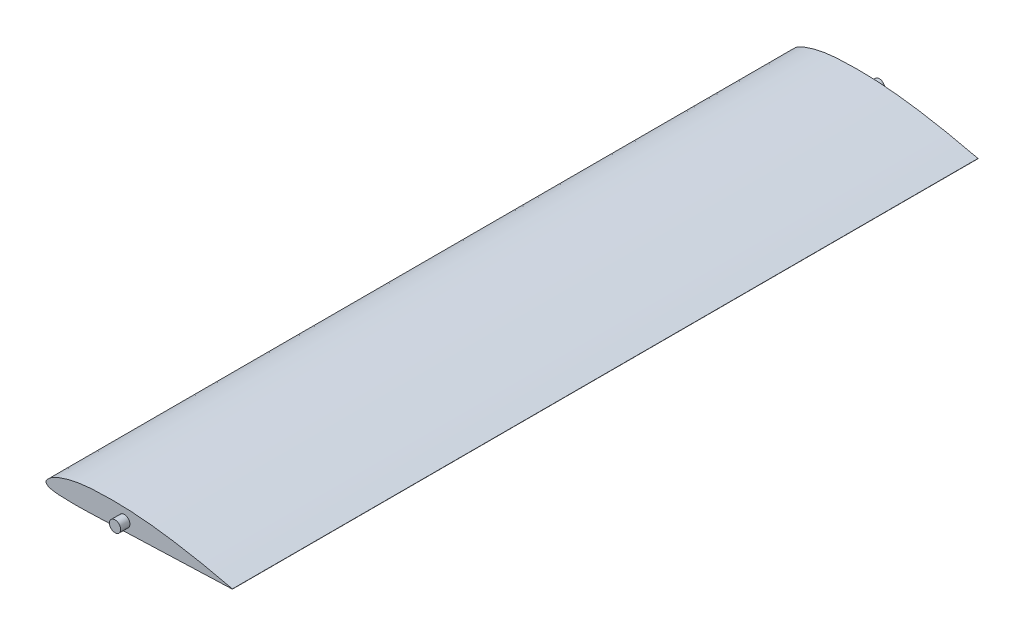
ISO-10303-21;
HEADER;
FILE_DESCRIPTION(('STEP AP214'),'2;1');
FILE_NAME('part.step','',(''),(''),'','','');
FILE_SCHEMA(('AUTOMOTIVE_DESIGN { 1 0 10303 214 1 1 1 1 }'));
ENDSEC;
DATA;
#1=APPLICATION_CONTEXT('core data for automotive mechanical design processes');
#2=APPLICATION_PROTOCOL_DEFINITION('international standard','automotive_design',2000,#1);
#3=PRODUCT_CONTEXT('',#1,'mechanical');
#4=PRODUCT('Part','Part','',(#3));
#5=PRODUCT_RELATED_PRODUCT_CATEGORY('part','',(#4));
#6=PRODUCT_DEFINITION_FORMATION('','',#4);
#7=PRODUCT_DEFINITION_CONTEXT('part definition',#1,'design');
#8=PRODUCT_DEFINITION('design','',#6,#7);
#9=PRODUCT_DEFINITION_SHAPE('','',#8);
#10=(LENGTH_UNIT() NAMED_UNIT(*) SI_UNIT(.MILLI.,.METRE.));
#11=(NAMED_UNIT(*) PLANE_ANGLE_UNIT() SI_UNIT($,.RADIAN.));
#12=(NAMED_UNIT(*) SI_UNIT($,.STERADIAN.) SOLID_ANGLE_UNIT());
#13=UNCERTAINTY_MEASURE_WITH_UNIT(LENGTH_MEASURE(1.E-05),#10,'distance_accuracy_value','');
#14=(GEOMETRIC_REPRESENTATION_CONTEXT(3) GLOBAL_UNCERTAINTY_ASSIGNED_CONTEXT((#13)) GLOBAL_UNIT_ASSIGNED_CONTEXT((#10,
#11,#12)) REPRESENTATION_CONTEXT('',''));
#15=CARTESIAN_POINT('',(0.,0.,0.));
#16=DIRECTION('',(0.,0.,1.));
#17=DIRECTION('',(1.,0.,0.));
#18=AXIS2_PLACEMENT_3D('',#15,#16,#17);
#19=CARTESIAN_POINT('',(100.,0.0599262388252568,200.));
#20=CARTESIAN_POINT('',(99.6666937471953,0.138937277819544,200.));
#21=CARTESIAN_POINT('',(99.0001200889136,0.29695014695678,200.));
#22=CARTESIAN_POINT('',(98.0002515533694,0.533477244963055,200.));
#23=CARTESIAN_POINT('',(97.000374753558,0.768863581512203,200.));
#24=CARTESIAN_POINT('',(95.6675638818466,1.08042383442665,200.));
#25=CARTESIAN_POINT('',(94.0015713267341,1.46392103728522,200.));
#26=CARTESIAN_POINT('',(92.0016073919942,1.91292836940954,200.));
#27=CARTESIAN_POINT('',(90.0016619586486,2.35152966974612,200.));
#28=CARTESIAN_POINT('',(88.0017829611692,2.78020773959593,200.));
#29=CARTESIAN_POINT('',(86.0019223338707,3.19874024657641,200.));
#30=CARTESIAN_POINT('',(83.3368337556686,3.74244691183134,200.));
#31=CARTESIAN_POINT('',(79.3412466183781,4.5250421804744,200.));
#32=CARTESIAN_POINT('',(75.3392538145284,5.25148062943361,200.));
#33=CARTESIAN_POINT('',(72.0027253739576,5.81745509130285,200.));
#34=CARTESIAN_POINT('',(69.3374940518809,6.25363383384628,200.));
#35=CARTESIAN_POINT('',(66.671131319661,6.66608548709222,200.));
#36=CARTESIAN_POINT('',(64.0033198872574,7.05020381979708,200.));
#37=CARTESIAN_POINT('',(62.0034586271341,7.32270043486086,200.));
#38=CARTESIAN_POINT('',(59.3383485069764,7.66383985259429,200.));
#39=CARTESIAN_POINT('',(56.6716358083318,7.96962568358589,200.));
#40=CARTESIAN_POINT('',(54.0037479902221,8.23951382186876,200.));
#41=CARTESIAN_POINT('',(52.0037982726727,8.4238676451509,200.));
#42=CARTESIAN_POINT('',(50.0038486317892,8.59013070529199,200.));
#43=CARTESIAN_POINT('',(48.0039333020934,8.73835747467576,200.));
#44=CARTESIAN_POINT('',(46.0040101309834,8.86719176837719,200.));
#45=CARTESIAN_POINT('',(44.0040593332397,8.97493832366112,200.));
#46=CARTESIAN_POINT('',(42.0040821596146,9.06001958046446,200.));
#47=CARTESIAN_POINT('',(40.0040731567784,9.1208964493308,200.));
#48=CARTESIAN_POINT('',(38.0040282570697,9.15563694063745,200.));
#49=CARTESIAN_POINT('',(36.0040108423488,9.16581868041082,200.));
#50=CARTESIAN_POINT('',(34.0040286769316,9.15359713766184,200.));
#51=CARTESIAN_POINT('',(32.0040752193951,9.12107905673638,200.));
#52=CARTESIAN_POINT('',(30.0041471019016,9.07004894425062,200.));
#53=CARTESIAN_POINT('',(28.0040546424125,9.00350156707454,200.));
#54=CARTESIAN_POINT('',(26.0037496913816,8.91339581318333,200.));
#55=CARTESIAN_POINT('',(24.0031983162326,8.7896544069115,200.));
#56=CARTESIAN_POINT('',(22.0023296617593,8.62243845725377,200.));
#57=CARTESIAN_POINT('',(20.0010745390591,8.40177808713544,200.));
#58=CARTESIAN_POINT('',(18.0001198967842,8.11642817046847,200.));
#59=CARTESIAN_POINT('',(15.999442233662,7.76590833510291,200.));
#60=CARTESIAN_POINT('',(13.9982119601745,7.35263431618153,200.));
#61=CARTESIAN_POINT('',(11.9957414652928,6.8724495756903,200.));
#62=CARTESIAN_POINT('',(9.99230431153847,6.31164730517832,200.));
#63=CARTESIAN_POINT('',(7.98916365138914,5.65305895317212,200.));
#64=CARTESIAN_POINT('',(6.3218293284431,5.02399233802199,200.));
#65=CARTESIAN_POINT('',(4.99299983329978,4.43216070472373,200.));
#66=CARTESIAN_POINT('',(3.98595394102813,3.9166422218935,200.));
#67=CARTESIAN_POINT('',(2.9699117061556,3.30400904730935,200.));
#68=CARTESIAN_POINT('',(2.0318835901488,2.5892541788095,200.));
#69=CARTESIAN_POINT('',(1.32737948939748,1.91099608261548,200.));
#70=CARTESIAN_POINT('',(0.789670593846766,1.36578653625942,200.));
#71=CARTESIAN_POINT('',(0.448168069350981,0.967197603138533,200.));
#72=CARTESIAN_POINT('',(0.223663801945147,0.624140905691418,200.));
#73=CARTESIAN_POINT('',(0.1137781557551,0.399455594554814,200.));
#74=CARTESIAN_POINT('',(0.043632385728852,0.205862057390237,200.));
#75=CARTESIAN_POINT('',(-0.0198883515278164,-0.0738589686266174,200.));
#76=CARTESIAN_POINT('',(0.0124051264481509,-0.364936741274751,200.));
#77=CARTESIAN_POINT('',(0.113724473026408,-0.618296039676128,200.));
#78=CARTESIAN_POINT('',(0.222486641363497,-0.819796167286998,200.));
#79=CARTESIAN_POINT('',(0.443568240966514,-1.11344864435438,200.));
#80=CARTESIAN_POINT('',(0.780453339052533,-1.4248000936736,200.));
#81=CARTESIAN_POINT('',(1.30604862893995,-1.78052396731398,200.));
#82=CARTESIAN_POINT('',(2.05183270843198,-2.06869764211714,200.));
#83=CARTESIAN_POINT('',(3.00325105018696,-2.26024676868709,200.));
#84=CARTESIAN_POINT('',(4.0024554593713,-2.45904698588516,200.));
#85=CARTESIAN_POINT('',(5.00311660931094,-2.61177293914944,200.));
#86=CARTESIAN_POINT('',(6.33653916249594,-2.7530354007047,200.));
#87=CARTESIAN_POINT('',(8.00492721912424,-2.84913347497257,200.));
#88=CARTESIAN_POINT('',(10.0049572494609,-2.94390068327674,200.));
#89=CARTESIAN_POINT('',(12.0052123395452,-3.00116332741795,200.));
#90=CARTESIAN_POINT('',(14.0053024566046,-3.0282522848526,200.));
#91=CARTESIAN_POINT('',(16.0053292778908,-3.02892273184658,200.));
#92=CARTESIAN_POINT('',(18.0052800224887,-3.00767531964872,200.));
#93=CARTESIAN_POINT('',(20.0051777945989,-2.9686328713825,200.));
#94=CARTESIAN_POINT('',(22.0050473068617,-2.91601512663668,200.));
#95=CARTESIAN_POINT('',(24.6716550963808,-2.83183500372688,200.));
#96=CARTESIAN_POINT('',(27.3380018749195,-2.73259929417434,200.));
#97=CARTESIAN_POINT('',(30.0043700143892,-2.63035819470935,200.));
#98=CARTESIAN_POINT('',(32.6708442720964,-2.53025362851953,200.));
#99=CARTESIAN_POINT('',(35.3373679416196,-2.4326649144542,200.));
#100=CARTESIAN_POINT('',(38.0038913254057,-2.33591665262994,200.));
#101=CARTESIAN_POINT('',(40.0037721780932,-2.26333625322643,200.));
#102=CARTESIAN_POINT('',(42.0036465977938,-2.19034482230209,200.));
#103=CARTESIAN_POINT('',(44.0035182461694,-2.11697830380754,200.));
#104=CARTESIAN_POINT('',(46.670017485067,-2.01890568610885,200.));
#105=CARTESIAN_POINT('',(50.0031312573799,-1.89598519544122,200.));
#106=CARTESIAN_POINT('',(53.3362590115835,-1.77348772259095,200.));
#107=CARTESIAN_POINT('',(56.0027611286881,-1.67561365785624,200.));
#108=CARTESIAN_POINT('',(58.0026356232561,-1.602215298639,200.));
#109=CARTESIAN_POINT('',(60.6691366143914,-1.50438396404022,200.));
#110=CARTESIAN_POINT('',(63.3356349399315,-1.40646333496689,200.));
#111=CARTESIAN_POINT('',(66.0021342888123,-1.30854391966599,200.));
#112=CARTESIAN_POINT('',(68.0020080156601,-1.23506799636606,200.));
#113=CARTESIAN_POINT('',(70.0018828544842,-1.16161901321269,200.));
#114=CARTESIAN_POINT('',(72.0017570255992,-1.08815851751289,200.));
#115=CARTESIAN_POINT('',(79.3346307898534,-0.818873580449789,200.));
#116=CARTESIAN_POINT('',(86.6675033412425,-0.549558952993169,200.));
#117=CARTESIAN_POINT('',(94.3336889484509,-0.268022582925601,200.));
#118=CARTESIAN_POINT('',(96.333563230566,-0.19457510815205,200.));
#119=CARTESIAN_POINT('',(98.3334383197885,-0.121146277650695,200.));
#120=CARTESIAN_POINT('',(99.3333751558733,-0.0844109030073011,200.));
#121=CARTESIAN_POINT('',(100.,-0.0599262388252568,200.));
#122=B_SPLINE_CURVE_WITH_KNOTS('',3,(#19,#20,#21,#22,#23,#24,#25,#26,#27,#28,#29,#30,#31,#32,
#33,#34,#35,#36,#37,#38,#39,#40,#41,#42,#43,#44,#45,#46,#47,#48,#49,#50,#51,#52,#53,#54,#55,#56,
#57,#58,#59,#60,#61,#62,#63,#64,#65,#66,#67,#68,#69,#70,#71,#72,#73,#74,#75,#76,#77,#78,#79,#80,
#81,#82,#83,#84,#85,#86,#87,#88,#89,#90,#91,#92,#93,#94,#95,#96,#97,#98,#99,#100,#101,#102,#103,
#104,#105,#106,#107,#108,#109,#110,#111,#112,#113,#114,#115,#116,#117,#118,#119,#120,#121),
.UNSPECIFIED.,.F.,.F.,(4,1,1,1,1,1,1,1,1,1,1,1,1,1,1,1,1,1,1,1,1,1,1,1,1,1,1,1,1,1,1,1,1,1,1,1,
1,1,1,1,1,1,1,1,1,1,1,1,1,1,1,1,1,1,1,1,1,1,1,1,1,1,1,1,1,1,1,1,1,1,1,1,1,1,1,1,1,1,1,1,1,1,1,1,
1,1,1,1,1,1,1,1,1,1,1,1,1,1,1,1,4),(0.,0.00502780144909913,0.0100550169006377,0.015080974345154,
0.0201050442625927,0.0301452176602554,0.0401735710380291,0.0501908143801514,0.0601976592093663,
0.0701941952761396,0.0801803076747985,0.100121039985459,0.129954283487186,0.139878670112855,
0.149793455313975,0.169594377782908,0.179479765251136,0.189354684839631,0.199219006508967,
0.218916577845098,0.228751143399973,0.238577240977566,0.248395623877617,0.258207005858822,
0.268011824770028,0.277810571771131,0.287603995418777,0.297393106812531,0.307179233213968,
0.316963997331707,0.326748797903093,0.33653469577821,0.346322446388005,0.356112708583029,
0.365907629610281,0.375711447611164,0.385530843159723,0.395375732502448,0.405259309582702,
0.415192466448778,0.425184001433878,0.435248265754516,0.445412161758921,0.45571079591912,
0.46619092382004,0.471552117343181,0.4770544290882,0.482786856201749,0.488945964995898,
0.494315961999465,0.497126380520384,0.500187407498847,0.502001032204753,0.503128101310879,
0.50384991606385,0.505020081617257,0.507317850057375,0.507986412168226,0.509023655480889,
0.51066801325332,0.513358343761831,0.515715835490153,0.519949409091746,0.524973134176378,
0.529954392708037,0.534903201948304,0.539824096808236,0.549630394694461,0.559425349382671,
0.569214158123137,0.578999725456637,0.588784356167783,0.598569501410984,0.608355927361906,
0.618143876254531,0.627933302401491,0.647515398126826,0.65730711994173,0.66709865127694,
0.68668110949836,0.696472189275363,0.706263270828206,0.716054412904857,0.725845617580213,
0.735636859958337,0.755219387900134,0.774801863673185,0.784593082698806,0.794384298135396,
0.804175511777837,0.823757953419086,0.833549177830085,0.843340405832555,0.853131632039167,
0.86292285824578,0.872714082656778,0.960835102355763,0.970626326766761,0.985313162485574,
0.990208773793388,1.),.UNSPECIFIED.);
#123=DIRECTION('',(0.,0.,-1.));
#124=VECTOR('',#123,1.);
#125=SURFACE_OF_LINEAR_EXTRUSION('',#122,#124);
#126=CARTESIAN_POINT('',(100.,0.0599262388252568,-200.));
#127=CARTESIAN_POINT('',(99.6666937471953,0.138937277819544,-200.));
#128=CARTESIAN_POINT('',(99.0001200889136,0.29695014695678,-200.));
#129=CARTESIAN_POINT('',(98.0002515533694,0.533477244963055,-200.));
#130=CARTESIAN_POINT('',(97.000374753558,0.768863581512203,-200.));
#131=CARTESIAN_POINT('',(95.6675638818466,1.08042383442665,-200.));
#132=CARTESIAN_POINT('',(94.0015713267341,1.46392103728522,-200.));
#133=CARTESIAN_POINT('',(92.0016073919942,1.91292836940954,-200.));
#134=CARTESIAN_POINT('',(90.0016619586486,2.35152966974612,-200.));
#135=CARTESIAN_POINT('',(88.0017829611692,2.78020773959593,-200.));
#136=CARTESIAN_POINT('',(86.0019223338707,3.19874024657641,-200.));
#137=CARTESIAN_POINT('',(83.3368337556686,3.74244691183134,-200.));
#138=CARTESIAN_POINT('',(79.3412466183781,4.5250421804744,-200.));
#139=CARTESIAN_POINT('',(75.3392538145284,5.25148062943361,-200.));
#140=CARTESIAN_POINT('',(72.0027253739576,5.81745509130285,-200.));
#141=CARTESIAN_POINT('',(69.3374940518809,6.25363383384628,-200.));
#142=CARTESIAN_POINT('',(66.671131319661,6.66608548709222,-200.));
#143=CARTESIAN_POINT('',(64.0033198872574,7.05020381979708,-200.));
#144=CARTESIAN_POINT('',(62.0034586271341,7.32270043486086,-200.));
#145=CARTESIAN_POINT('',(59.3383485069764,7.66383985259429,-200.));
#146=CARTESIAN_POINT('',(56.6716358083318,7.96962568358589,-200.));
#147=CARTESIAN_POINT('',(54.0037479902221,8.23951382186876,-200.));
#148=CARTESIAN_POINT('',(52.0037982726727,8.4238676451509,-200.));
#149=CARTESIAN_POINT('',(50.0038486317892,8.59013070529199,-200.));
#150=CARTESIAN_POINT('',(48.0039333020934,8.73835747467576,-200.));
#151=CARTESIAN_POINT('',(46.0040101309834,8.86719176837719,-200.));
#152=CARTESIAN_POINT('',(44.0040593332397,8.97493832366112,-200.));
#153=CARTESIAN_POINT('',(42.0040821596146,9.06001958046446,-200.));
#154=CARTESIAN_POINT('',(40.0040731567784,9.1208964493308,-200.));
#155=CARTESIAN_POINT('',(38.0040282570697,9.15563694063745,-200.));
#156=CARTESIAN_POINT('',(36.0040108423488,9.16581868041082,-200.));
#157=CARTESIAN_POINT('',(34.0040286769316,9.15359713766184,-200.));
#158=CARTESIAN_POINT('',(32.0040752193951,9.12107905673638,-200.));
#159=CARTESIAN_POINT('',(30.0041471019016,9.07004894425062,-200.));
#160=CARTESIAN_POINT('',(28.0040546424125,9.00350156707454,-200.));
#161=CARTESIAN_POINT('',(26.0037496913816,8.91339581318333,-200.));
#162=CARTESIAN_POINT('',(24.0031983162326,8.7896544069115,-200.));
#163=CARTESIAN_POINT('',(22.0023296617593,8.62243845725377,-200.));
#164=CARTESIAN_POINT('',(20.0010745390591,8.40177808713544,-200.));
#165=CARTESIAN_POINT('',(18.0001198967842,8.11642817046847,-200.));
#166=CARTESIAN_POINT('',(15.999442233662,7.76590833510291,-200.));
#167=CARTESIAN_POINT('',(13.9982119601745,7.35263431618153,-200.));
#168=CARTESIAN_POINT('',(11.9957414652928,6.8724495756903,-200.));
#169=CARTESIAN_POINT('',(9.99230431153847,6.31164730517832,-200.));
#170=CARTESIAN_POINT('',(7.98916365138914,5.65305895317212,-200.));
#171=CARTESIAN_POINT('',(6.3218293284431,5.02399233802199,-200.));
#172=CARTESIAN_POINT('',(4.99299983329978,4.43216070472373,-200.));
#173=CARTESIAN_POINT('',(3.98595394102813,3.9166422218935,-200.));
#174=CARTESIAN_POINT('',(2.9699117061556,3.30400904730935,-200.));
#175=CARTESIAN_POINT('',(2.0318835901488,2.5892541788095,-200.));
#176=CARTESIAN_POINT('',(1.32737948939748,1.91099608261548,-200.));
#177=CARTESIAN_POINT('',(0.789670593846766,1.36578653625942,-200.));
#178=CARTESIAN_POINT('',(0.448168069350981,0.967197603138533,-200.));
#179=CARTESIAN_POINT('',(0.223663801945147,0.624140905691418,-200.));
#180=CARTESIAN_POINT('',(0.1137781557551,0.399455594554814,-200.));
#181=CARTESIAN_POINT('',(0.043632385728852,0.205862057390237,-200.));
#182=CARTESIAN_POINT('',(-0.0198883515278164,-0.0738589686266174,-200.));
#183=CARTESIAN_POINT('',(0.0124051264481509,-0.364936741274751,-200.));
#184=CARTESIAN_POINT('',(0.113724473026408,-0.618296039676128,-200.));
#185=CARTESIAN_POINT('',(0.222486641363497,-0.819796167286998,-200.));
#186=CARTESIAN_POINT('',(0.443568240966514,-1.11344864435438,-200.));
#187=CARTESIAN_POINT('',(0.780453339052533,-1.4248000936736,-200.));
#188=CARTESIAN_POINT('',(1.30604862893995,-1.78052396731398,-200.));
#189=CARTESIAN_POINT('',(2.05183270843198,-2.06869764211714,-200.));
#190=CARTESIAN_POINT('',(3.00325105018696,-2.26024676868709,-200.));
#191=CARTESIAN_POINT('',(4.0024554593713,-2.45904698588516,-200.));
#192=CARTESIAN_POINT('',(5.00311660931094,-2.61177293914944,-200.));
#193=CARTESIAN_POINT('',(6.33653916249594,-2.7530354007047,-200.));
#194=CARTESIAN_POINT('',(8.00492721912424,-2.84913347497257,-200.));
#195=CARTESIAN_POINT('',(10.0049572494609,-2.94390068327674,-200.));
#196=CARTESIAN_POINT('',(12.0052123395452,-3.00116332741795,-200.));
#197=CARTESIAN_POINT('',(14.0053024566046,-3.0282522848526,-200.));
#198=CARTESIAN_POINT('',(16.0053292778908,-3.02892273184658,-200.));
#199=CARTESIAN_POINT('',(18.0052800224887,-3.00767531964872,-200.));
#200=CARTESIAN_POINT('',(20.0051777945989,-2.9686328713825,-200.));
#201=CARTESIAN_POINT('',(22.0050473068617,-2.91601512663668,-200.));
#202=CARTESIAN_POINT('',(24.6716550963808,-2.83183500372688,-200.));
#203=CARTESIAN_POINT('',(27.3380018749195,-2.73259929417434,-200.));
#204=CARTESIAN_POINT('',(30.0043700143892,-2.63035819470935,-200.));
#205=CARTESIAN_POINT('',(32.6708442720964,-2.53025362851953,-200.));
#206=CARTESIAN_POINT('',(35.3373679416196,-2.4326649144542,-200.));
#207=CARTESIAN_POINT('',(38.0038913254057,-2.33591665262994,-200.));
#208=CARTESIAN_POINT('',(40.0037721780932,-2.26333625322643,-200.));
#209=CARTESIAN_POINT('',(42.0036465977938,-2.19034482230209,-200.));
#210=CARTESIAN_POINT('',(44.0035182461694,-2.11697830380754,-200.));
#211=CARTESIAN_POINT('',(46.670017485067,-2.01890568610885,-200.));
#212=CARTESIAN_POINT('',(50.0031312573799,-1.89598519544122,-200.));
#213=CARTESIAN_POINT('',(53.3362590115835,-1.77348772259095,-200.));
#214=CARTESIAN_POINT('',(56.0027611286881,-1.67561365785624,-200.));
#215=CARTESIAN_POINT('',(58.0026356232561,-1.602215298639,-200.));
#216=CARTESIAN_POINT('',(60.6691366143914,-1.50438396404022,-200.));
#217=CARTESIAN_POINT('',(63.3356349399315,-1.40646333496689,-200.));
#218=CARTESIAN_POINT('',(66.0021342888123,-1.30854391966599,-200.));
#219=CARTESIAN_POINT('',(68.0020080156601,-1.23506799636606,-200.));
#220=CARTESIAN_POINT('',(70.0018828544842,-1.16161901321269,-200.));
#221=CARTESIAN_POINT('',(72.0017570255992,-1.08815851751289,-200.));
#222=CARTESIAN_POINT('',(79.3346307898534,-0.818873580449789,-200.));
#223=CARTESIAN_POINT('',(86.6675033412425,-0.549558952993169,-200.));
#224=CARTESIAN_POINT('',(94.3336889484509,-0.268022582925601,-200.));
#225=CARTESIAN_POINT('',(96.333563230566,-0.19457510815205,-200.));
#226=CARTESIAN_POINT('',(98.3334383197885,-0.121146277650695,-200.));
#227=CARTESIAN_POINT('',(99.3333751558733,-0.0844109030073011,-200.));
#228=CARTESIAN_POINT('',(100.,-0.0599262388252568,-200.));
#229=B_SPLINE_CURVE_WITH_KNOTS('',3,(#126,#127,#128,#129,#130,#131,#132,#133,#134,#135,#136,
#137,#138,#139,#140,#141,#142,#143,#144,#145,#146,#147,#148,#149,#150,#151,#152,#153,#154,#155,
#156,#157,#158,#159,#160,#161,#162,#163,#164,#165,#166,#167,#168,#169,#170,#171,#172,#173,#174,
#175,#176,#177,#178,#179,#180,#181,#182,#183,#184,#185,#186,#187,#188,#189,#190,#191,#192,#193,
#194,#195,#196,#197,#198,#199,#200,#201,#202,#203,#204,#205,#206,#207,#208,#209,#210,#211,#212,
#213,#214,#215,#216,#217,#218,#219,#220,#221,#222,#223,#224,#225,#226,#227,#228),.UNSPECIFIED.,
.F.,.F.,(4,1,1,1,1,1,1,1,1,1,1,1,1,1,1,1,1,1,1,1,1,1,1,1,1,1,1,1,1,1,1,1,1,1,1,1,1,1,1,1,1,1,1,
1,1,1,1,1,1,1,1,1,1,1,1,1,1,1,1,1,1,1,1,1,1,1,1,1,1,1,1,1,1,1,1,1,1,1,1,1,1,1,1,1,1,1,1,1,1,1,1,
1,1,1,1,1,1,1,1,1,4),(0.,0.00502780144909913,0.0100550169006377,0.015080974345154,
0.0201050442625927,0.0301452176602554,0.0401735710380291,0.0501908143801514,0.0601976592093663,
0.0701941952761396,0.0801803076747985,0.100121039985459,0.129954283487186,0.139878670112855,
0.149793455313975,0.169594377782908,0.179479765251136,0.189354684839631,0.199219006508967,
0.218916577845098,0.228751143399973,0.238577240977566,0.248395623877617,0.258207005858822,
0.268011824770028,0.277810571771131,0.287603995418777,0.297393106812531,0.307179233213968,
0.316963997331707,0.326748797903093,0.33653469577821,0.346322446388005,0.356112708583029,
0.365907629610281,0.375711447611164,0.385530843159723,0.395375732502448,0.405259309582702,
0.415192466448778,0.425184001433878,0.435248265754516,0.445412161758921,0.45571079591912,
0.46619092382004,0.471552117343181,0.4770544290882,0.482786856201749,0.488945964995898,
0.494315961999465,0.497126380520384,0.500187407498847,0.502001032204753,0.503128101310879,
0.50384991606385,0.505020081617257,0.507317850057375,0.507986412168226,0.509023655480889,
0.51066801325332,0.513358343761831,0.515715835490153,0.519949409091746,0.524973134176378,
0.529954392708037,0.534903201948304,0.539824096808236,0.549630394694461,0.559425349382671,
0.569214158123137,0.578999725456637,0.588784356167783,0.598569501410984,0.608355927361906,
0.618143876254531,0.627933302401491,0.647515398126826,0.65730711994173,0.66709865127694,
0.68668110949836,0.696472189275363,0.706263270828206,0.716054412904857,0.725845617580213,
0.735636859958337,0.755219387900134,0.774801863673185,0.784593082698806,0.794384298135396,
0.804175511777837,0.823757953419086,0.833549177830085,0.843340405832555,0.853131632039167,
0.86292285824578,0.872714082656778,0.960835102355763,0.970626326766761,0.985313162485574,
0.990208773793388,1.),.UNSPECIFIED.);
#230=CARTESIAN_POINT('',(100.,0.0599262388252568,-200.));
#231=VERTEX_POINT('',#230);
#232=CARTESIAN_POINT('',(100.,-0.0599262388252568,-200.));
#233=VERTEX_POINT('',#232);
#234=EDGE_CURVE('E67',#231,#233,#229,.T.);
#235=ORIENTED_EDGE('',*,*,#234,.T.);
#236=DIRECTION('',(0.,0.,-1.));
#237=VECTOR('',#236,1.);
#238=CARTESIAN_POINT('',(100.,-0.0599262388252568,200.));
#239=LINE('',#238,#237);
#240=CARTESIAN_POINT('',(100.,-0.0599262388252568,200.));
#241=VERTEX_POINT('',#240);
#242=EDGE_CURVE('E49',#241,#233,#239,.T.);
#243=ORIENTED_EDGE('',*,*,#242,.F.);
#244=CARTESIAN_POINT('',(100.,0.0599262388252568,200.));
#245=VERTEX_POINT('',#244);
#246=EDGE_CURVE('E69',#245,#241,#122,.T.);
#247=ORIENTED_EDGE('',*,*,#246,.F.);
#248=DIRECTION('',(0.,0.,-1.));
#249=VECTOR('',#248,1.);
#250=CARTESIAN_POINT('',(100.,0.0599262388252568,200.));
#251=LINE('',#250,#249);
#252=EDGE_CURVE('E57',#245,#231,#251,.T.);
#253=ORIENTED_EDGE('',*,*,#252,.T.);
#254=EDGE_LOOP('',(#235,#243,#247,#253));
#255=FACE_BOUND('',#254,.T.);
#256=ADVANCED_FACE('F40',(#255),#125,.F.);
#257=CARTESIAN_POINT('',(100.,0.0599262388252568,200.));
#258=DIRECTION('',(1.,0.,0.));
#259=DIRECTION('',(0.,0.,-1.));
#260=AXIS2_PLACEMENT_3D('',#257,#258,#259);
#261=PLANE('',#260);
#262=DIRECTION('',(0.,-1.,0.));
#263=VECTOR('',#262,1.);
#264=CARTESIAN_POINT('',(100.,0.0599262388252568,-200.));
#265=LINE('',#264,#263);
#266=EDGE_CURVE('E75',#231,#233,#265,.T.);
#267=ORIENTED_EDGE('',*,*,#266,.F.);
#268=ORIENTED_EDGE('',*,*,#252,.F.);
#269=DIRECTION('',(0.,-1.,0.));
#270=VECTOR('',#269,1.);
#271=CARTESIAN_POINT('',(100.,0.0599262388252568,200.));
#272=LINE('',#271,#270);
#273=EDGE_CURVE('E71',#245,#241,#272,.T.);
#274=ORIENTED_EDGE('',*,*,#273,.T.);
#275=ORIENTED_EDGE('',*,*,#242,.T.);
#276=EDGE_LOOP('',(#267,#268,#274,#275));
#277=FACE_BOUND('',#276,.T.);
#278=ADVANCED_FACE('F78',(#277),#261,.T.);
#279=CARTESIAN_POINT('',(0.428902417831239,0.923239688894012,200.));
#280=DIRECTION('',(0.,0.,-1.));
#281=DIRECTION('',(-1.,0.,0.));
#282=AXIS2_PLACEMENT_3D('',#279,#280,#281);
#283=PLANE('',#282);
#284=CARTESIAN_POINT('',(42.0369180056575,2.66916615668644,200.));
#285=DIRECTION('',(0.,0.,-1.));
#286=DIRECTION('',(-1.,0.,0.));
#287=AXIS2_PLACEMENT_3D('',#284,#285,#286);
#288=CIRCLE('',#287,3.);
#289=CARTESIAN_POINT('',(39.0369180056575,2.66916615668644,200.));
#290=VERTEX_POINT('',#289);
#291=EDGE_CURVE('E90',#290,#290,#288,.T.);
#292=ORIENTED_EDGE('',*,*,#291,.T.);
#293=EDGE_LOOP('',(#292));
#294=FACE_BOUND('',#293,.T.);
#295=ORIENTED_EDGE('',*,*,#246,.T.);
#296=ORIENTED_EDGE('',*,*,#273,.F.);
#297=EDGE_LOOP('',(#295,#296));
#298=FACE_BOUND('',#297,.T.);
#299=ADVANCED_FACE('F113',(#294,#298),#283,.F.);
#300=CARTESIAN_POINT('',(0.428902417831239,0.923239688894012,-200.));
#301=DIRECTION('',(0.,0.,-1.));
#302=DIRECTION('',(-1.,0.,0.));
#303=AXIS2_PLACEMENT_3D('',#300,#301,#302);
#304=PLANE('',#303);
#305=CARTESIAN_POINT('',(42.0369180056575,2.66916615668644,-200.));
#306=DIRECTION('',(0.,0.,-1.));
#307=DIRECTION('',(-1.,0.,0.));
#308=AXIS2_PLACEMENT_3D('',#305,#306,#307);
#309=CIRCLE('',#308,3.);
#310=CARTESIAN_POINT('',(39.0369180056575,2.66916615668644,-200.));
#311=VERTEX_POINT('',#310);
#312=EDGE_CURVE('E11',#311,#311,#309,.T.);
#313=ORIENTED_EDGE('',*,*,#312,.F.);
#314=EDGE_LOOP('',(#313));
#315=FACE_BOUND('',#314,.T.);
#316=ORIENTED_EDGE('',*,*,#234,.F.);
#317=ORIENTED_EDGE('',*,*,#266,.T.);
#318=EDGE_LOOP('',(#316,#317));
#319=FACE_BOUND('',#318,.T.);
#320=ADVANCED_FACE('F74',(#315,#319),#304,.T.);
#321=CARTESIAN_POINT('',(42.0369180056575,2.66916615668644,205.));
#322=DIRECTION('',(0.,0.,-1.));
#323=DIRECTION('',(-1.,0.,0.));
#324=AXIS2_PLACEMENT_3D('',#321,#322,#323);
#325=CYLINDRICAL_SURFACE('',#324,3.);
#326=CARTESIAN_POINT('',(42.0369180056575,2.66916615668644,205.));
#327=DIRECTION('',(0.,0.,-1.));
#328=DIRECTION('',(-1.,0.,0.));
#329=AXIS2_PLACEMENT_3D('',#326,#327,#328);
#330=CIRCLE('',#329,3.);
#331=CARTESIAN_POINT('',(39.0369180056575,2.66916615668644,205.));
#332=VERTEX_POINT('',#331);
#333=EDGE_CURVE('E76',#332,#332,#330,.T.);
#334=ORIENTED_EDGE('',*,*,#333,.T.);
#335=EDGE_LOOP('',(#334));
#336=FACE_BOUND('',#335,.T.);
#337=ORIENTED_EDGE('',*,*,#291,.F.);
#338=EDGE_LOOP('',(#337));
#339=FACE_BOUND('',#338,.T.);
#340=ADVANCED_FACE('F112',(#336,#339),#325,.T.);
#341=CARTESIAN_POINT('',(42.0369180056575,2.66916615668644,205.));
#342=DIRECTION('',(0.,0.,-1.));
#343=DIRECTION('',(-1.,0.,0.));
#344=AXIS2_PLACEMENT_3D('',#341,#342,#343);
#345=PLANE('',#344);
#346=ORIENTED_EDGE('',*,*,#333,.F.);
#347=EDGE_LOOP('',(#346));
#348=FACE_BOUND('',#347,.T.);
#349=ADVANCED_FACE('F107',(#348),#345,.F.);
#350=CARTESIAN_POINT('',(42.0369180056575,2.66916615668644,-205.));
#351=DIRECTION('',(0.,0.,1.));
#352=DIRECTION('',(-1.,0.,0.));
#353=AXIS2_PLACEMENT_3D('',#350,#351,#352);
#354=CYLINDRICAL_SURFACE('',#353,3.);
#355=CARTESIAN_POINT('',(42.0369180056575,2.66916615668644,-205.));
#356=DIRECTION('',(0.,0.,-1.));
#357=DIRECTION('',(-1.,0.,0.));
#358=AXIS2_PLACEMENT_3D('',#355,#356,#357);
#359=CIRCLE('',#358,3.);
#360=CARTESIAN_POINT('',(39.0369180056575,2.66916615668644,-205.));
#361=VERTEX_POINT('',#360);
#362=EDGE_CURVE('E96',#361,#361,#359,.T.);
#363=ORIENTED_EDGE('',*,*,#362,.F.);
#364=EDGE_LOOP('',(#363));
#365=FACE_BOUND('',#364,.T.);
#366=ORIENTED_EDGE('',*,*,#312,.T.);
#367=EDGE_LOOP('',(#366));
#368=FACE_BOUND('',#367,.T.);
#369=ADVANCED_FACE('F104',(#365,#368),#354,.T.);
#370=CARTESIAN_POINT('',(42.0369180056575,2.66916615668644,-205.));
#371=DIRECTION('',(0.,0.,1.));
#372=DIRECTION('',(-1.,0.,0.));
#373=AXIS2_PLACEMENT_3D('',#370,#371,#372);
#374=PLANE('',#373);
#375=ORIENTED_EDGE('',*,*,#362,.T.);
#376=EDGE_LOOP('',(#375));
#377=FACE_BOUND('',#376,.T.);
#378=ADVANCED_FACE('F102',(#377),#374,.F.);
#379=CLOSED_SHELL('',(#256,#278,#299,#320,#340,#349,#369,#378));
#380=MANIFOLD_SOLID_BREP('B2',#379);
#381=ADVANCED_BREP_SHAPE_REPRESENTATION('',(#18,#380),#14);
#382=SHAPE_DEFINITION_REPRESENTATION(#9,#381);
ENDSEC;
END-ISO-10303-21;
